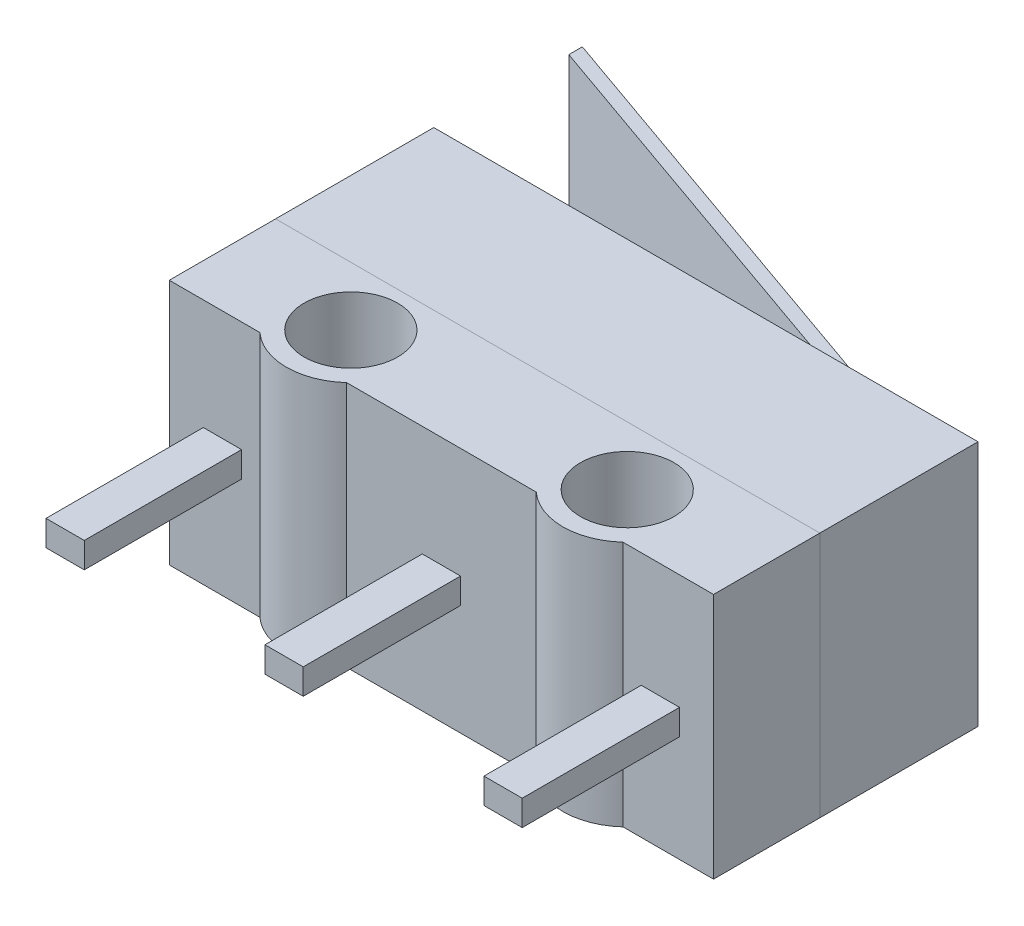
ISO-10303-21;
HEADER;
FILE_DESCRIPTION(('STEP AP214'),'2;1');
FILE_NAME('part.step','',(''),(''),'','','');
FILE_SCHEMA(('AUTOMOTIVE_DESIGN { 1 0 10303 214 1 1 1 1 }'));
ENDSEC;
DATA;
#1=APPLICATION_CONTEXT('core data for automotive mechanical design processes');
#2=APPLICATION_PROTOCOL_DEFINITION('international standard','automotive_design',2000,#1);
#3=PRODUCT_CONTEXT('',#1,'mechanical');
#4=PRODUCT('Part','Part','',(#3));
#5=PRODUCT_RELATED_PRODUCT_CATEGORY('part','',(#4));
#6=PRODUCT_DEFINITION_FORMATION('','',#4);
#7=PRODUCT_DEFINITION_CONTEXT('part definition',#1,'design');
#8=PRODUCT_DEFINITION('design','',#6,#7);
#9=PRODUCT_DEFINITION_SHAPE('','',#8);
#10=(LENGTH_UNIT() NAMED_UNIT(*) SI_UNIT(.MILLI.,.METRE.));
#11=(NAMED_UNIT(*) PLANE_ANGLE_UNIT() SI_UNIT($,.RADIAN.));
#12=(NAMED_UNIT(*) SI_UNIT($,.STERADIAN.) SOLID_ANGLE_UNIT());
#13=UNCERTAINTY_MEASURE_WITH_UNIT(LENGTH_MEASURE(1.E-05),#10,'distance_accuracy_value','');
#14=(GEOMETRIC_REPRESENTATION_CONTEXT(3) GLOBAL_UNCERTAINTY_ASSIGNED_CONTEXT((#13)) GLOBAL_UNIT_ASSIGNED_CONTEXT((#10,
#11,#12)) REPRESENTATION_CONTEXT('',''));
#15=CARTESIAN_POINT('',(0.,0.,0.));
#16=DIRECTION('',(0.,0.,1.));
#17=DIRECTION('',(1.,0.,0.));
#18=AXIS2_PLACEMENT_3D('',#15,#16,#17);
#19=CARTESIAN_POINT('',(0.,0.,6.22));
#20=DIRECTION('',(0.,-1.,0.));
#21=DIRECTION('',(0.,0.,-1.));
#22=AXIS2_PLACEMENT_3D('',#19,#20,#21);
#23=PLANE('',#22);
#24=DIRECTION('',(0.,0.,-1.));
#25=VECTOR('',#24,1.);
#26=CARTESIAN_POINT('',(0.,0.,6.22));
#27=LINE('',#26,#25);
#28=CARTESIAN_POINT('',(0.,0.,3.72));
#29=VERTEX_POINT('',#28);
#30=CARTESIAN_POINT('',(0.,0.,0.));
#31=VERTEX_POINT('',#30);
#32=EDGE_CURVE('E396',#29,#31,#27,.T.);
#33=ORIENTED_EDGE('',*,*,#32,.F.);
#34=DIRECTION('',(-1.,0.,0.));
#35=VECTOR('',#34,1.);
#36=CARTESIAN_POINT('',(0.,0.,3.72));
#37=LINE('',#36,#35);
#38=CARTESIAN_POINT('',(-12.8,0.,3.72));
#39=VERTEX_POINT('',#38);
#40=EDGE_CURVE('E12',#29,#39,#37,.T.);
#41=ORIENTED_EDGE('',*,*,#40,.T.);
#42=DIRECTION('',(0.,0.,-1.));
#43=VECTOR('',#42,1.);
#44=CARTESIAN_POINT('',(-12.8,0.,6.22));
#45=LINE('',#44,#43);
#46=CARTESIAN_POINT('',(-12.8,0.,0.));
#47=VERTEX_POINT('',#46);
#48=EDGE_CURVE('E411',#39,#47,#45,.T.);
#49=ORIENTED_EDGE('',*,*,#48,.T.);
#50=DIRECTION('',(-1.,0.,0.));
#51=VECTOR('',#50,1.);
#52=CARTESIAN_POINT('',(0.,0.,0.));
#53=LINE('',#52,#51);
#54=EDGE_CURVE('E384',#31,#47,#53,.T.);
#55=ORIENTED_EDGE('',*,*,#54,.F.);
#56=EDGE_LOOP('',(#33,#41,#49,#55));
#57=FACE_BOUND('',#56,.T.);
#58=ADVANCED_FACE('F48',(#57),#23,.T.);
#59=CARTESIAN_POINT('',(-12.8,0.,6.22));
#60=DIRECTION('',(-1.,0.,0.));
#61=DIRECTION('',(0.,0.,1.));
#62=AXIS2_PLACEMENT_3D('',#59,#60,#61);
#63=PLANE('',#62);
#64=ORIENTED_EDGE('',*,*,#48,.F.);
#65=DIRECTION('',(0.,1.,0.));
#66=VECTOR('',#65,1.);
#67=CARTESIAN_POINT('',(-12.8,0.,3.72));
#68=LINE('',#67,#66);
#69=CARTESIAN_POINT('',(-12.8,5.8,3.72));
#70=VERTEX_POINT('',#69);
#71=EDGE_CURVE('E56',#39,#70,#68,.T.);
#72=ORIENTED_EDGE('',*,*,#71,.T.);
#73=DIRECTION('',(0.,0.,-1.));
#74=VECTOR('',#73,1.);
#75=CARTESIAN_POINT('',(-12.8,5.8,6.22));
#76=LINE('',#75,#74);
#77=CARTESIAN_POINT('',(-12.8,5.8,0.));
#78=VERTEX_POINT('',#77);
#79=EDGE_CURVE('E415',#70,#78,#76,.T.);
#80=ORIENTED_EDGE('',*,*,#79,.T.);
#81=DIRECTION('',(0.,1.,0.));
#82=VECTOR('',#81,1.);
#83=CARTESIAN_POINT('',(-12.8,0.,0.));
#84=LINE('',#83,#82);
#85=EDGE_CURVE('E403',#47,#78,#84,.T.);
#86=ORIENTED_EDGE('',*,*,#85,.F.);
#87=EDGE_LOOP('',(#64,#72,#80,#86));
#88=FACE_BOUND('',#87,.T.);
#89=ADVANCED_FACE('F477',(#88),#63,.T.);
#90=CARTESIAN_POINT('',(0.,5.8,6.22));
#91=DIRECTION('',(0.,-1.,0.));
#92=DIRECTION('',(1.,0.,0.));
#93=AXIS2_PLACEMENT_3D('',#90,#91,#92);
#94=PLANE('',#93);
#95=CARTESIAN_POINT('',(-3.15,5.8,5.1));
#96=DIRECTION('',(0.,-1.,0.));
#97=DIRECTION('',(0.,0.,-1.));
#98=AXIS2_PLACEMENT_3D('',#95,#96,#97);
#99=CIRCLE('',#98,1.1);
#100=CARTESIAN_POINT('',(-3.15,5.8,4.));
#101=VERTEX_POINT('',#100);
#102=EDGE_CURVE('E370',#101,#101,#99,.T.);
#103=ORIENTED_EDGE('',*,*,#102,.T.);
#104=EDGE_LOOP('',(#103));
#105=FACE_BOUND('',#104,.T.);
#106=CARTESIAN_POINT('',(-9.65,5.8,5.1));
#107=DIRECTION('',(0.,-1.,0.));
#108=DIRECTION('',(0.,0.,-1.));
#109=AXIS2_PLACEMENT_3D('',#106,#107,#108);
#110=CIRCLE('',#109,1.1);
#111=CARTESIAN_POINT('',(-9.65,5.8,4.));
#112=VERTEX_POINT('',#111);
#113=EDGE_CURVE('E376',#112,#112,#110,.T.);
#114=ORIENTED_EDGE('',*,*,#113,.T.);
#115=EDGE_LOOP('',(#114));
#116=FACE_BOUND('',#115,.T.);
#117=DIRECTION('',(0.,0.,-1.));
#118=VECTOR('',#117,1.);
#119=CARTESIAN_POINT('',(0.,5.8,6.22));
#120=LINE('',#119,#118);
#121=CARTESIAN_POINT('',(0.,5.8,6.22));
#122=VERTEX_POINT('',#121);
#123=CARTESIAN_POINT('',(0.,5.8,3.72));
#124=VERTEX_POINT('',#123);
#125=EDGE_CURVE('E420',#122,#124,#120,.T.);
#126=ORIENTED_EDGE('',*,*,#125,.T.);
#127=DIRECTION('',(-1.,0.,0.));
#128=VECTOR('',#127,1.);
#129=CARTESIAN_POINT('',(0.,5.8,3.72));
#130=LINE('',#129,#128);
#131=EDGE_CURVE('E426',#124,#70,#130,.T.);
#132=ORIENTED_EDGE('',*,*,#131,.T.);
#133=CARTESIAN_POINT('',(-12.8,5.8,6.22));
#134=VERTEX_POINT('',#133);
#135=EDGE_CURVE('E416',#134,#70,#76,.T.);
#136=ORIENTED_EDGE('',*,*,#135,.F.);
#137=DIRECTION('',(-1.,0.,0.));
#138=VECTOR('',#137,1.);
#139=CARTESIAN_POINT('',(0.,5.8,6.22));
#140=LINE('',#139,#138);
#141=CARTESIAN_POINT('',(-10.6702083120618,5.8,6.22));
#142=VERTEX_POINT('',#141);
#143=EDGE_CURVE('E383',#142,#134,#140,.T.);
#144=ORIENTED_EDGE('',*,*,#143,.F.);
#145=CARTESIAN_POINT('',(-9.65,5.8,5.1));
#146=DIRECTION('',(0.,-1.,0.));
#147=DIRECTION('',(0.,0.,-1.));
#148=AXIS2_PLACEMENT_3D('',#145,#146,#147);
#149=CIRCLE('',#148,1.515);
#150=CARTESIAN_POINT('',(-8.62979168793819,5.8,6.22));
#151=VERTEX_POINT('',#150);
#152=EDGE_CURVE('E358',#151,#142,#149,.T.);
#153=ORIENTED_EDGE('',*,*,#152,.F.);
#154=CARTESIAN_POINT('',(-4.17020831206181,5.8,6.22));
#155=VERTEX_POINT('',#154);
#156=EDGE_CURVE('E389',#155,#151,#140,.T.);
#157=ORIENTED_EDGE('',*,*,#156,.F.);
#158=CARTESIAN_POINT('',(-3.15,5.8,5.1));
#159=DIRECTION('',(0.,-1.,0.));
#160=DIRECTION('',(0.,0.,-1.));
#161=AXIS2_PLACEMENT_3D('',#158,#159,#160);
#162=CIRCLE('',#161,1.515);
#163=CARTESIAN_POINT('',(-2.12979168793819,5.8,6.22));
#164=VERTEX_POINT('',#163);
#165=EDGE_CURVE('E348',#164,#155,#162,.T.);
#166=ORIENTED_EDGE('',*,*,#165,.F.);
#167=EDGE_CURVE('E385',#122,#164,#140,.T.);
#168=ORIENTED_EDGE('',*,*,#167,.F.);
#169=EDGE_LOOP('',(#126,#132,#136,#144,#153,#157,#166,#168));
#170=FACE_BOUND('',#169,.T.);
#171=ADVANCED_FACE('F430',(#105,#116,#170),#94,.F.);
#172=CARTESIAN_POINT('',(0.,0.,6.22));
#173=DIRECTION('',(-1.,0.,0.));
#174=DIRECTION('',(0.,0.,1.));
#175=AXIS2_PLACEMENT_3D('',#172,#173,#174);
#176=PLANE('',#175);
#177=CARTESIAN_POINT('',(0.,0.,6.22));
#178=VERTEX_POINT('',#177);
#179=EDGE_CURVE('E408',#178,#29,#27,.T.);
#180=ORIENTED_EDGE('',*,*,#179,.T.);
#181=DIRECTION('',(0.,1.,0.));
#182=VECTOR('',#181,1.);
#183=CARTESIAN_POINT('',(0.,0.,3.72));
#184=LINE('',#183,#182);
#185=EDGE_CURVE('E423',#29,#124,#184,.T.);
#186=ORIENTED_EDGE('',*,*,#185,.T.);
#187=ORIENTED_EDGE('',*,*,#125,.F.);
#188=DIRECTION('',(0.,1.,0.));
#189=VECTOR('',#188,1.);
#190=CARTESIAN_POINT('',(0.,0.,6.22));
#191=LINE('',#190,#189);
#192=EDGE_CURVE('E380',#178,#122,#191,.T.);
#193=ORIENTED_EDGE('',*,*,#192,.F.);
#194=EDGE_LOOP('',(#180,#186,#187,#193));
#195=FACE_BOUND('',#194,.T.);
#196=ADVANCED_FACE('F469',(#195),#176,.F.);
#197=CARTESIAN_POINT('',(0.,0.,6.22));
#198=DIRECTION('',(0.,0.,1.));
#199=DIRECTION('',(1.,0.,0.));
#200=AXIS2_PLACEMENT_3D('',#197,#198,#199);
#201=PLANE('',#200);
#202=DIRECTION('',(0.,-1.,0.));
#203=VECTOR('',#202,1.);
#204=CARTESIAN_POINT('',(-2.12979168793819,5.8,6.22));
#205=LINE('',#204,#203);
#206=CARTESIAN_POINT('',(-2.12979168793819,0.,6.22));
#207=VERTEX_POINT('',#206);
#208=EDGE_CURVE('E352',#164,#207,#205,.T.);
#209=ORIENTED_EDGE('',*,*,#208,.T.);
#210=DIRECTION('',(-1.,0.,0.));
#211=VECTOR('',#210,1.);
#212=CARTESIAN_POINT('',(0.,0.,6.22));
#213=LINE('',#212,#211);
#214=EDGE_CURVE('E393',#178,#207,#213,.T.);
#215=ORIENTED_EDGE('',*,*,#214,.F.);
#216=ORIENTED_EDGE('',*,*,#192,.T.);
#217=ORIENTED_EDGE('',*,*,#167,.T.);
#218=EDGE_LOOP('',(#209,#215,#216,#217));
#219=FACE_BOUND('',#218,.T.);
#220=DIRECTION('',(1.,0.,0.));
#221=VECTOR('',#220,1.);
#222=CARTESIAN_POINT('',(-1.7,2.5,6.22));
#223=LINE('',#222,#221);
#224=CARTESIAN_POINT('',(-1.7,2.5,6.22));
#225=VERTEX_POINT('',#224);
#226=CARTESIAN_POINT('',(-0.800000000000001,2.5,6.22));
#227=VERTEX_POINT('',#226);
#228=EDGE_CURVE('E274',#225,#227,#223,.T.);
#229=ORIENTED_EDGE('',*,*,#228,.F.);
#230=DIRECTION('',(0.,-1.,0.));
#231=VECTOR('',#230,1.);
#232=CARTESIAN_POINT('',(-1.7,3.1,6.22));
#233=LINE('',#232,#231);
#234=CARTESIAN_POINT('',(-1.7,3.1,6.22));
#235=VERTEX_POINT('',#234);
#236=EDGE_CURVE('E229',#235,#225,#233,.T.);
#237=ORIENTED_EDGE('',*,*,#236,.F.);
#238=DIRECTION('',(-1.,0.,0.));
#239=VECTOR('',#238,1.);
#240=CARTESIAN_POINT('',(-1.7,3.1,6.22));
#241=LINE('',#240,#239);
#242=CARTESIAN_POINT('',(-0.800000000000001,3.1,6.22));
#243=VERTEX_POINT('',#242);
#244=EDGE_CURVE('E265',#243,#235,#241,.T.);
#245=ORIENTED_EDGE('',*,*,#244,.F.);
#246=DIRECTION('',(0.,1.,0.));
#247=VECTOR('',#246,1.);
#248=CARTESIAN_POINT('',(-0.800000000000001,3.1,6.22));
#249=LINE('',#248,#247);
#250=EDGE_CURVE('E276',#227,#243,#249,.T.);
#251=ORIENTED_EDGE('',*,*,#250,.F.);
#252=EDGE_LOOP('',(#229,#237,#245,#251));
#253=FACE_BOUND('',#252,.T.);
#254=ADVANCED_FACE('F465',(#219,#253),#201,.T.);
#255=DIRECTION('',(0.,-1.,0.));
#256=VECTOR('',#255,1.);
#257=CARTESIAN_POINT('',(-10.6702083120618,5.8,6.22));
#258=LINE('',#257,#256);
#259=CARTESIAN_POINT('',(-10.6702083120618,0.,6.22));
#260=VERTEX_POINT('',#259);
#261=EDGE_CURVE('E360',#142,#260,#258,.T.);
#262=ORIENTED_EDGE('',*,*,#261,.F.);
#263=ORIENTED_EDGE('',*,*,#143,.T.);
#264=DIRECTION('',(0.,1.,0.));
#265=VECTOR('',#264,1.);
#266=CARTESIAN_POINT('',(-12.8,0.,6.22));
#267=LINE('',#266,#265);
#268=CARTESIAN_POINT('',(-12.8,0.,6.22));
#269=VERTEX_POINT('',#268);
#270=EDGE_CURVE('E388',#269,#134,#267,.T.);
#271=ORIENTED_EDGE('',*,*,#270,.F.);
#272=EDGE_CURVE('E392',#260,#269,#213,.T.);
#273=ORIENTED_EDGE('',*,*,#272,.F.);
#274=EDGE_LOOP('',(#262,#263,#271,#273));
#275=FACE_BOUND('',#274,.T.);
#276=DIRECTION('',(1.,0.,0.));
#277=VECTOR('',#276,1.);
#278=CARTESIAN_POINT('',(-12.,2.6,6.22));
#279=LINE('',#278,#277);
#280=CARTESIAN_POINT('',(-12.,2.6,6.22));
#281=VERTEX_POINT('',#280);
#282=CARTESIAN_POINT('',(-11.1,2.6,6.22));
#283=VERTEX_POINT('',#282);
#284=EDGE_CURVE('E303',#281,#283,#279,.T.);
#285=ORIENTED_EDGE('',*,*,#284,.F.);
#286=DIRECTION('',(0.,-1.,0.));
#287=VECTOR('',#286,1.);
#288=CARTESIAN_POINT('',(-12.,3.2,6.22));
#289=LINE('',#288,#287);
#290=CARTESIAN_POINT('',(-12.,3.2,6.22));
#291=VERTEX_POINT('',#290);
#292=EDGE_CURVE('E289',#291,#281,#289,.T.);
#293=ORIENTED_EDGE('',*,*,#292,.F.);
#294=DIRECTION('',(-1.,0.,0.));
#295=VECTOR('',#294,1.);
#296=CARTESIAN_POINT('',(-12.,3.2,6.22));
#297=LINE('',#296,#295);
#298=CARTESIAN_POINT('',(-11.1,3.2,6.22));
#299=VERTEX_POINT('',#298);
#300=EDGE_CURVE('E294',#299,#291,#297,.T.);
#301=ORIENTED_EDGE('',*,*,#300,.F.);
#302=DIRECTION('',(0.,1.,0.));
#303=VECTOR('',#302,1.);
#304=CARTESIAN_POINT('',(-11.1,3.2,6.22));
#305=LINE('',#304,#303);
#306=EDGE_CURVE('E305',#283,#299,#305,.T.);
#307=ORIENTED_EDGE('',*,*,#306,.F.);
#308=EDGE_LOOP('',(#285,#293,#301,#307));
#309=FACE_BOUND('',#308,.T.);
#310=ADVANCED_FACE('F444',(#275,#309),#201,.T.);
#311=DIRECTION('',(0.,-1.,0.));
#312=VECTOR('',#311,1.);
#313=CARTESIAN_POINT('',(-4.17020831206181,5.8,6.22));
#314=LINE('',#313,#312);
#315=CARTESIAN_POINT('',(-4.17020831206181,0.,6.22));
#316=VERTEX_POINT('',#315);
#317=EDGE_CURVE('E350',#155,#316,#314,.T.);
#318=ORIENTED_EDGE('',*,*,#317,.F.);
#319=ORIENTED_EDGE('',*,*,#156,.T.);
#320=DIRECTION('',(0.,-1.,0.));
#321=VECTOR('',#320,1.);
#322=CARTESIAN_POINT('',(-8.62979168793819,5.8,6.22));
#323=LINE('',#322,#321);
#324=CARTESIAN_POINT('',(-8.62979168793819,0.,6.22));
#325=VERTEX_POINT('',#324);
#326=EDGE_CURVE('E362',#151,#325,#323,.T.);
#327=ORIENTED_EDGE('',*,*,#326,.T.);
#328=EDGE_CURVE('E397',#316,#325,#213,.T.);
#329=ORIENTED_EDGE('',*,*,#328,.F.);
#330=EDGE_LOOP('',(#318,#319,#327,#329));
#331=FACE_BOUND('',#330,.T.);
#332=DIRECTION('',(1.,0.,0.));
#333=VECTOR('',#332,1.);
#334=CARTESIAN_POINT('',(-6.85,2.6,6.22));
#335=LINE('',#334,#333);
#336=CARTESIAN_POINT('',(-6.85,2.6,6.22));
#337=VERTEX_POINT('',#336);
#338=CARTESIAN_POINT('',(-5.95,2.6,6.22));
#339=VERTEX_POINT('',#338);
#340=EDGE_CURVE('E332',#337,#339,#335,.T.);
#341=ORIENTED_EDGE('',*,*,#340,.F.);
#342=DIRECTION('',(0.,-1.,0.));
#343=VECTOR('',#342,1.);
#344=CARTESIAN_POINT('',(-6.85,3.2,6.22));
#345=LINE('',#344,#343);
#346=CARTESIAN_POINT('',(-6.85,3.2,6.22));
#347=VERTEX_POINT('',#346);
#348=EDGE_CURVE('E318',#347,#337,#345,.T.);
#349=ORIENTED_EDGE('',*,*,#348,.F.);
#350=DIRECTION('',(-1.,0.,0.));
#351=VECTOR('',#350,1.);
#352=CARTESIAN_POINT('',(-6.85,3.2,6.22));
#353=LINE('',#352,#351);
#354=CARTESIAN_POINT('',(-5.95,3.2,6.22));
#355=VERTEX_POINT('',#354);
#356=EDGE_CURVE('E323',#355,#347,#353,.T.);
#357=ORIENTED_EDGE('',*,*,#356,.F.);
#358=DIRECTION('',(0.,1.,0.));
#359=VECTOR('',#358,1.);
#360=CARTESIAN_POINT('',(-5.95,3.2,6.22));
#361=LINE('',#360,#359);
#362=EDGE_CURVE('E334',#339,#355,#361,.T.);
#363=ORIENTED_EDGE('',*,*,#362,.F.);
#364=EDGE_LOOP('',(#341,#349,#357,#363));
#365=FACE_BOUND('',#364,.T.);
#366=ADVANCED_FACE('F451',(#331,#365),#201,.T.);
#367=ORIENTED_EDGE('',*,*,#185,.F.);
#368=ORIENTED_EDGE('',*,*,#32,.T.);
#369=DIRECTION('',(0.,1.,0.));
#370=VECTOR('',#369,1.);
#371=CARTESIAN_POINT('',(0.,0.,0.));
#372=LINE('',#371,#370);
#373=CARTESIAN_POINT('',(0.,5.8,0.));
#374=VERTEX_POINT('',#373);
#375=EDGE_CURVE('E379',#31,#374,#372,.T.);
#376=ORIENTED_EDGE('',*,*,#375,.T.);
#377=EDGE_CURVE('E419',#124,#374,#120,.T.);
#378=ORIENTED_EDGE('',*,*,#377,.F.);
#379=EDGE_LOOP('',(#367,#368,#376,#378));
#380=FACE_BOUND('',#379,.T.);
#381=ADVANCED_FACE('F50',(#380),#176,.F.);
#382=ORIENTED_EDGE('',*,*,#131,.F.);
#383=ORIENTED_EDGE('',*,*,#377,.T.);
#384=DIRECTION('',(-1.,0.,0.));
#385=VECTOR('',#384,1.);
#386=CARTESIAN_POINT('',(0.,5.8,0.));
#387=LINE('',#386,#385);
#388=EDGE_CURVE('E400',#374,#78,#387,.T.);
#389=ORIENTED_EDGE('',*,*,#388,.T.);
#390=ORIENTED_EDGE('',*,*,#79,.F.);
#391=EDGE_LOOP('',(#382,#383,#389,#390));
#392=FACE_BOUND('',#391,.T.);
#393=ADVANCED_FACE('F434',(#392),#94,.F.);
#394=ORIENTED_EDGE('',*,*,#71,.F.);
#395=EDGE_CURVE('E412',#269,#39,#45,.T.);
#396=ORIENTED_EDGE('',*,*,#395,.F.);
#397=ORIENTED_EDGE('',*,*,#270,.T.);
#398=ORIENTED_EDGE('',*,*,#135,.T.);
#399=EDGE_LOOP('',(#394,#396,#397,#398));
#400=FACE_BOUND('',#399,.T.);
#401=ADVANCED_FACE('F438',(#400),#63,.T.);
#402=ORIENTED_EDGE('',*,*,#40,.F.);
#403=ORIENTED_EDGE('',*,*,#179,.F.);
#404=ORIENTED_EDGE('',*,*,#214,.T.);
#405=CARTESIAN_POINT('',(-3.15,0.,5.1));
#406=DIRECTION('',(0.,-1.,0.));
#407=DIRECTION('',(0.,0.,-1.));
#408=AXIS2_PLACEMENT_3D('',#405,#406,#407);
#409=CIRCLE('',#408,1.515);
#410=EDGE_CURVE('E347',#207,#316,#409,.T.);
#411=ORIENTED_EDGE('',*,*,#410,.T.);
#412=ORIENTED_EDGE('',*,*,#328,.T.);
#413=CARTESIAN_POINT('',(-9.65,0.,5.1));
#414=DIRECTION('',(0.,-1.,0.));
#415=DIRECTION('',(0.,0.,-1.));
#416=AXIS2_PLACEMENT_3D('',#413,#414,#415);
#417=CIRCLE('',#416,1.515);
#418=EDGE_CURVE('E355',#325,#260,#417,.T.);
#419=ORIENTED_EDGE('',*,*,#418,.T.);
#420=ORIENTED_EDGE('',*,*,#272,.T.);
#421=ORIENTED_EDGE('',*,*,#395,.T.);
#422=EDGE_LOOP('',(#402,#403,#404,#411,#412,#419,#420,#421));
#423=FACE_BOUND('',#422,.T.);
#424=CARTESIAN_POINT('',(-3.15,0.,5.1));
#425=DIRECTION('',(0.,-1.,0.));
#426=DIRECTION('',(0.,0.,-1.));
#427=AXIS2_PLACEMENT_3D('',#424,#425,#426);
#428=CIRCLE('',#427,1.09999999999999);
#429=CARTESIAN_POINT('',(-3.15,0.,4.00000000000001));
#430=VERTEX_POINT('',#429);
#431=EDGE_CURVE('E365',#430,#430,#428,.T.);
#432=ORIENTED_EDGE('',*,*,#431,.F.);
#433=EDGE_LOOP('',(#432));
#434=FACE_BOUND('',#433,.T.);
#435=CARTESIAN_POINT('',(-9.65,0.,5.1));
#436=DIRECTION('',(0.,-1.,0.));
#437=DIRECTION('',(0.,0.,-1.));
#438=AXIS2_PLACEMENT_3D('',#435,#436,#437);
#439=CIRCLE('',#438,1.09999999999999);
#440=CARTESIAN_POINT('',(-9.65,0.,4.00000000000001));
#441=VERTEX_POINT('',#440);
#442=EDGE_CURVE('E373',#441,#441,#439,.T.);
#443=ORIENTED_EDGE('',*,*,#442,.F.);
#444=EDGE_LOOP('',(#443));
#445=FACE_BOUND('',#444,.T.);
#446=ADVANCED_FACE('F459',(#423,#434,#445),#23,.T.);
#447=CARTESIAN_POINT('',(0.,0.,0.));
#448=DIRECTION('',(0.,0.,1.));
#449=DIRECTION('',(1.,0.,0.));
#450=AXIS2_PLACEMENT_3D('',#447,#448,#449);
#451=PLANE('',#450);
#452=DIRECTION('',(0.,-1.,0.));
#453=VECTOR('',#452,1.);
#454=CARTESIAN_POINT('',(-0.547326270828165,4.45,0.));
#455=LINE('',#454,#453);
#456=CARTESIAN_POINT('',(-0.547326270828165,4.45,0.));
#457=VERTEX_POINT('',#456);
#458=CARTESIAN_POINT('',(-0.547326270828165,1.35,0.));
#459=VERTEX_POINT('',#458);
#460=EDGE_CURVE('E257',#457,#459,#455,.T.);
#461=ORIENTED_EDGE('',*,*,#460,.F.);
#462=DIRECTION('',(1.,0.,0.));
#463=VECTOR('',#462,1.);
#464=CARTESIAN_POINT('',(0.,4.45,0.));
#465=LINE('',#464,#463);
#466=CARTESIAN_POINT('',(-1.45267372917184,4.45,0.));
#467=VERTEX_POINT('',#466);
#468=EDGE_CURVE('E243',#467,#457,#465,.T.);
#469=ORIENTED_EDGE('',*,*,#468,.F.);
#470=DIRECTION('',(0.,-1.,0.));
#471=VECTOR('',#470,1.);
#472=CARTESIAN_POINT('',(-1.45267372917183,4.45,0.));
#473=LINE('',#472,#471);
#474=CARTESIAN_POINT('',(-1.45267372917183,1.35,0.));
#475=VERTEX_POINT('',#474);
#476=EDGE_CURVE('E230',#467,#475,#473,.T.);
#477=ORIENTED_EDGE('',*,*,#476,.T.);
#478=DIRECTION('',(1.,0.,0.));
#479=VECTOR('',#478,1.);
#480=CARTESIAN_POINT('',(0.,1.35,0.));
#481=LINE('',#480,#479);
#482=EDGE_CURVE('E252',#475,#459,#481,.T.);
#483=ORIENTED_EDGE('',*,*,#482,.T.);
#484=EDGE_LOOP('',(#461,#469,#477,#483));
#485=FACE_BOUND('',#484,.T.);
#486=ORIENTED_EDGE('',*,*,#375,.F.);
#487=ORIENTED_EDGE('',*,*,#54,.T.);
#488=ORIENTED_EDGE('',*,*,#85,.T.);
#489=ORIENTED_EDGE('',*,*,#388,.F.);
#490=EDGE_LOOP('',(#486,#487,#488,#489));
#491=FACE_BOUND('',#490,.T.);
#492=ADVANCED_FACE('F475',(#485,#491),#451,.F.);
#493=CARTESIAN_POINT('',(-9.65,0.,5.1));
#494=DIRECTION('',(0.,-1.,0.));
#495=DIRECTION('',(0.,0.,-1.));
#496=AXIS2_PLACEMENT_3D('',#493,#494,#495);
#497=CYLINDRICAL_SURFACE('',#496,1.09999999999999);
#498=ORIENTED_EDGE('',*,*,#113,.F.);
#499=EDGE_LOOP('',(#498));
#500=FACE_BOUND('',#499,.T.);
#501=ORIENTED_EDGE('',*,*,#442,.T.);
#502=EDGE_LOOP('',(#501));
#503=FACE_BOUND('',#502,.T.);
#504=ADVANCED_FACE('F490',(#500,#503),#497,.F.);
#505=CARTESIAN_POINT('',(-3.15,0.,5.1));
#506=DIRECTION('',(0.,-1.,0.));
#507=DIRECTION('',(0.,0.,-1.));
#508=AXIS2_PLACEMENT_3D('',#505,#506,#507);
#509=CYLINDRICAL_SURFACE('',#508,1.09999999999999);
#510=ORIENTED_EDGE('',*,*,#102,.F.);
#511=EDGE_LOOP('',(#510));
#512=FACE_BOUND('',#511,.T.);
#513=ORIENTED_EDGE('',*,*,#431,.T.);
#514=EDGE_LOOP('',(#513));
#515=FACE_BOUND('',#514,.T.);
#516=ADVANCED_FACE('F509',(#512,#515),#509,.F.);
#517=CARTESIAN_POINT('',(-9.65,5.8,5.1));
#518=DIRECTION('',(0.,-1.,0.));
#519=DIRECTION('',(0.,0.,-1.));
#520=AXIS2_PLACEMENT_3D('',#517,#518,#519);
#521=CYLINDRICAL_SURFACE('',#520,1.515);
#522=ORIENTED_EDGE('',*,*,#418,.F.);
#523=ORIENTED_EDGE('',*,*,#326,.F.);
#524=ORIENTED_EDGE('',*,*,#152,.T.);
#525=ORIENTED_EDGE('',*,*,#261,.T.);
#526=EDGE_LOOP('',(#522,#523,#524,#525));
#527=FACE_BOUND('',#526,.T.);
#528=ADVANCED_FACE('F457',(#527),#521,.T.);
#529=CARTESIAN_POINT('',(-3.15,5.8,5.1));
#530=DIRECTION('',(0.,-1.,0.));
#531=DIRECTION('',(0.,0.,-1.));
#532=AXIS2_PLACEMENT_3D('',#529,#530,#531);
#533=CYLINDRICAL_SURFACE('',#532,1.515);
#534=ORIENTED_EDGE('',*,*,#410,.F.);
#535=ORIENTED_EDGE('',*,*,#208,.F.);
#536=ORIENTED_EDGE('',*,*,#165,.T.);
#537=ORIENTED_EDGE('',*,*,#317,.T.);
#538=EDGE_LOOP('',(#534,#535,#536,#537));
#539=FACE_BOUND('',#538,.T.);
#540=ADVANCED_FACE('F463',(#539),#533,.T.);
#541=CARTESIAN_POINT('',(-6.85,3.2,9.92));
#542=DIRECTION('',(1.,0.,0.));
#543=DIRECTION('',(0.,0.,-1.));
#544=AXIS2_PLACEMENT_3D('',#541,#542,#543);
#545=PLANE('',#544);
#546=ORIENTED_EDGE('',*,*,#348,.T.);
#547=DIRECTION('',(0.,0.,-1.));
#548=VECTOR('',#547,1.);
#549=CARTESIAN_POINT('',(-6.85,2.6,9.92));
#550=LINE('',#549,#548);
#551=CARTESIAN_POINT('',(-6.85,2.6,9.92));
#552=VERTEX_POINT('',#551);
#553=EDGE_CURVE('E345',#552,#337,#550,.T.);
#554=ORIENTED_EDGE('',*,*,#553,.F.);
#555=DIRECTION('',(0.,-1.,0.));
#556=VECTOR('',#555,1.);
#557=CARTESIAN_POINT('',(-6.85,3.2,9.92));
#558=LINE('',#557,#556);
#559=CARTESIAN_POINT('',(-6.85,3.2,9.92));
#560=VERTEX_POINT('',#559);
#561=EDGE_CURVE('E319',#560,#552,#558,.T.);
#562=ORIENTED_EDGE('',*,*,#561,.F.);
#563=DIRECTION('',(0.,0.,-1.));
#564=VECTOR('',#563,1.);
#565=CARTESIAN_POINT('',(-6.85,3.2,9.92));
#566=LINE('',#565,#564);
#567=EDGE_CURVE('E329',#560,#347,#566,.T.);
#568=ORIENTED_EDGE('',*,*,#567,.T.);
#569=EDGE_LOOP('',(#546,#554,#562,#568));
#570=FACE_BOUND('',#569,.T.);
#571=ADVANCED_FACE('F580',(#570),#545,.F.);
#572=CARTESIAN_POINT('',(-6.85,2.6,9.92));
#573=DIRECTION('',(0.,1.,0.));
#574=DIRECTION('',(0.,0.,1.));
#575=AXIS2_PLACEMENT_3D('',#572,#573,#574);
#576=PLANE('',#575);
#577=ORIENTED_EDGE('',*,*,#340,.T.);
#578=DIRECTION('',(0.,0.,-1.));
#579=VECTOR('',#578,1.);
#580=CARTESIAN_POINT('',(-5.95,2.6,9.92));
#581=LINE('',#580,#579);
#582=CARTESIAN_POINT('',(-5.95,2.6,9.92));
#583=VERTEX_POINT('',#582);
#584=EDGE_CURVE('E342',#583,#339,#581,.T.);
#585=ORIENTED_EDGE('',*,*,#584,.F.);
#586=DIRECTION('',(1.,0.,0.));
#587=VECTOR('',#586,1.);
#588=CARTESIAN_POINT('',(-6.85,2.6,9.92));
#589=LINE('',#588,#587);
#590=EDGE_CURVE('E322',#552,#583,#589,.T.);
#591=ORIENTED_EDGE('',*,*,#590,.F.);
#592=ORIENTED_EDGE('',*,*,#553,.T.);
#593=EDGE_LOOP('',(#577,#585,#591,#592));
#594=FACE_BOUND('',#593,.T.);
#595=ADVANCED_FACE('F589',(#594),#576,.F.);
#596=CARTESIAN_POINT('',(-5.95,3.2,9.92));
#597=DIRECTION('',(-1.,0.,0.));
#598=DIRECTION('',(0.,-1.,0.));
#599=AXIS2_PLACEMENT_3D('',#596,#597,#598);
#600=PLANE('',#599);
#601=ORIENTED_EDGE('',*,*,#362,.T.);
#602=DIRECTION('',(0.,0.,-1.));
#603=VECTOR('',#602,1.);
#604=CARTESIAN_POINT('',(-5.95,3.2,9.92));
#605=LINE('',#604,#603);
#606=CARTESIAN_POINT('',(-5.95,3.2,9.92));
#607=VERTEX_POINT('',#606);
#608=EDGE_CURVE('E340',#607,#355,#605,.T.);
#609=ORIENTED_EDGE('',*,*,#608,.F.);
#610=DIRECTION('',(0.,1.,0.));
#611=VECTOR('',#610,1.);
#612=CARTESIAN_POINT('',(-5.95,3.2,9.92));
#613=LINE('',#612,#611);
#614=EDGE_CURVE('E325',#583,#607,#613,.T.);
#615=ORIENTED_EDGE('',*,*,#614,.F.);
#616=ORIENTED_EDGE('',*,*,#584,.T.);
#617=EDGE_LOOP('',(#601,#609,#615,#616));
#618=FACE_BOUND('',#617,.T.);
#619=ADVANCED_FACE('F600',(#618),#600,.F.);
#620=CARTESIAN_POINT('',(-6.85,3.2,9.92));
#621=DIRECTION('',(0.,-1.,0.));
#622=DIRECTION('',(0.,0.,-1.));
#623=AXIS2_PLACEMENT_3D('',#620,#621,#622);
#624=PLANE('',#623);
#625=ORIENTED_EDGE('',*,*,#356,.T.);
#626=ORIENTED_EDGE('',*,*,#567,.F.);
#627=DIRECTION('',(-1.,0.,0.));
#628=VECTOR('',#627,1.);
#629=CARTESIAN_POINT('',(-6.85,3.2,9.92));
#630=LINE('',#629,#628);
#631=EDGE_CURVE('E327',#607,#560,#630,.T.);
#632=ORIENTED_EDGE('',*,*,#631,.F.);
#633=ORIENTED_EDGE('',*,*,#608,.T.);
#634=EDGE_LOOP('',(#625,#626,#632,#633));
#635=FACE_BOUND('',#634,.T.);
#636=ADVANCED_FACE('F610',(#635),#624,.F.);
#637=CARTESIAN_POINT('',(0.,0.,9.92));
#638=DIRECTION('',(0.,0.,1.));
#639=DIRECTION('',(1.,0.,0.));
#640=AXIS2_PLACEMENT_3D('',#637,#638,#639);
#641=PLANE('',#640);
#642=ORIENTED_EDGE('',*,*,#561,.T.);
#643=ORIENTED_EDGE('',*,*,#590,.T.);
#644=ORIENTED_EDGE('',*,*,#614,.T.);
#645=ORIENTED_EDGE('',*,*,#631,.T.);
#646=EDGE_LOOP('',(#642,#643,#644,#645));
#647=FACE_BOUND('',#646,.T.);
#648=ADVANCED_FACE('F620',(#647),#641,.T.);
#649=CARTESIAN_POINT('',(-12.,3.2,9.92));
#650=DIRECTION('',(1.,0.,0.));
#651=DIRECTION('',(0.,0.,-1.));
#652=AXIS2_PLACEMENT_3D('',#649,#650,#651);
#653=PLANE('',#652);
#654=ORIENTED_EDGE('',*,*,#292,.T.);
#655=DIRECTION('',(0.,0.,-1.));
#656=VECTOR('',#655,1.);
#657=CARTESIAN_POINT('',(-12.,2.6,9.92));
#658=LINE('',#657,#656);
#659=CARTESIAN_POINT('',(-12.,2.6,9.92));
#660=VERTEX_POINT('',#659);
#661=EDGE_CURVE('E316',#660,#281,#658,.T.);
#662=ORIENTED_EDGE('',*,*,#661,.F.);
#663=DIRECTION('',(0.,-1.,0.));
#664=VECTOR('',#663,1.);
#665=CARTESIAN_POINT('',(-12.,3.2,9.92));
#666=LINE('',#665,#664);
#667=CARTESIAN_POINT('',(-12.,3.2,9.92));
#668=VERTEX_POINT('',#667);
#669=EDGE_CURVE('E290',#668,#660,#666,.T.);
#670=ORIENTED_EDGE('',*,*,#669,.F.);
#671=DIRECTION('',(0.,0.,-1.));
#672=VECTOR('',#671,1.);
#673=CARTESIAN_POINT('',(-12.,3.2,9.92));
#674=LINE('',#673,#672);
#675=EDGE_CURVE('E300',#668,#291,#674,.T.);
#676=ORIENTED_EDGE('',*,*,#675,.T.);
#677=EDGE_LOOP('',(#654,#662,#670,#676));
#678=FACE_BOUND('',#677,.T.);
#679=ADVANCED_FACE('F630',(#678),#653,.F.);
#680=CARTESIAN_POINT('',(-12.,2.6,9.92));
#681=DIRECTION('',(0.,1.,0.));
#682=DIRECTION('',(0.,0.,1.));
#683=AXIS2_PLACEMENT_3D('',#680,#681,#682);
#684=PLANE('',#683);
#685=ORIENTED_EDGE('',*,*,#284,.T.);
#686=DIRECTION('',(0.,0.,-1.));
#687=VECTOR('',#686,1.);
#688=CARTESIAN_POINT('',(-11.1,2.6,9.92));
#689=LINE('',#688,#687);
#690=CARTESIAN_POINT('',(-11.1,2.6,9.92));
#691=VERTEX_POINT('',#690);
#692=EDGE_CURVE('E313',#691,#283,#689,.T.);
#693=ORIENTED_EDGE('',*,*,#692,.F.);
#694=DIRECTION('',(1.,0.,0.));
#695=VECTOR('',#694,1.);
#696=CARTESIAN_POINT('',(-12.,2.6,9.92));
#697=LINE('',#696,#695);
#698=EDGE_CURVE('E293',#660,#691,#697,.T.);
#699=ORIENTED_EDGE('',*,*,#698,.F.);
#700=ORIENTED_EDGE('',*,*,#661,.T.);
#701=EDGE_LOOP('',(#685,#693,#699,#700));
#702=FACE_BOUND('',#701,.T.);
#703=ADVANCED_FACE('F640',(#702),#684,.F.);
#704=CARTESIAN_POINT('',(-11.1,3.2,9.92));
#705=DIRECTION('',(-1.,0.,0.));
#706=DIRECTION('',(0.,0.,1.));
#707=AXIS2_PLACEMENT_3D('',#704,#705,#706);
#708=PLANE('',#707);
#709=ORIENTED_EDGE('',*,*,#306,.T.);
#710=DIRECTION('',(0.,0.,-1.));
#711=VECTOR('',#710,1.);
#712=CARTESIAN_POINT('',(-11.1,3.2,9.92));
#713=LINE('',#712,#711);
#714=CARTESIAN_POINT('',(-11.1,3.2,9.92));
#715=VERTEX_POINT('',#714);
#716=EDGE_CURVE('E311',#715,#299,#713,.T.);
#717=ORIENTED_EDGE('',*,*,#716,.F.);
#718=DIRECTION('',(0.,1.,0.));
#719=VECTOR('',#718,1.);
#720=CARTESIAN_POINT('',(-11.1,3.2,9.92));
#721=LINE('',#720,#719);
#722=EDGE_CURVE('E296',#691,#715,#721,.T.);
#723=ORIENTED_EDGE('',*,*,#722,.F.);
#724=ORIENTED_EDGE('',*,*,#692,.T.);
#725=EDGE_LOOP('',(#709,#717,#723,#724));
#726=FACE_BOUND('',#725,.T.);
#727=ADVANCED_FACE('F650',(#726),#708,.F.);
#728=CARTESIAN_POINT('',(-12.,3.2,9.92));
#729=DIRECTION('',(0.,-1.,0.));
#730=DIRECTION('',(1.,0.,0.));
#731=AXIS2_PLACEMENT_3D('',#728,#729,#730);
#732=PLANE('',#731);
#733=ORIENTED_EDGE('',*,*,#300,.T.);
#734=ORIENTED_EDGE('',*,*,#675,.F.);
#735=DIRECTION('',(-1.,0.,0.));
#736=VECTOR('',#735,1.);
#737=CARTESIAN_POINT('',(-12.,3.2,9.92));
#738=LINE('',#737,#736);
#739=EDGE_CURVE('E298',#715,#668,#738,.T.);
#740=ORIENTED_EDGE('',*,*,#739,.F.);
#741=ORIENTED_EDGE('',*,*,#716,.T.);
#742=EDGE_LOOP('',(#733,#734,#740,#741));
#743=FACE_BOUND('',#742,.T.);
#744=ADVANCED_FACE('F660',(#743),#732,.F.);
#745=CARTESIAN_POINT('',(0.,0.,9.92));
#746=DIRECTION('',(0.,0.,1.));
#747=DIRECTION('',(1.,0.,0.));
#748=AXIS2_PLACEMENT_3D('',#745,#746,#747);
#749=PLANE('',#748);
#750=ORIENTED_EDGE('',*,*,#669,.T.);
#751=ORIENTED_EDGE('',*,*,#698,.T.);
#752=ORIENTED_EDGE('',*,*,#722,.T.);
#753=ORIENTED_EDGE('',*,*,#739,.T.);
#754=EDGE_LOOP('',(#750,#751,#752,#753));
#755=FACE_BOUND('',#754,.T.);
#756=ADVANCED_FACE('F670',(#755),#749,.T.);
#757=CARTESIAN_POINT('',(-1.7,3.1,9.92));
#758=DIRECTION('',(1.,0.,0.));
#759=DIRECTION('',(0.,0.,-1.));
#760=AXIS2_PLACEMENT_3D('',#757,#758,#759);
#761=PLANE('',#760);
#762=ORIENTED_EDGE('',*,*,#236,.T.);
#763=DIRECTION('',(0.,0.,-1.));
#764=VECTOR('',#763,1.);
#765=CARTESIAN_POINT('',(-1.7,2.5,9.92));
#766=LINE('',#765,#764);
#767=CARTESIAN_POINT('',(-1.7,2.5,9.92));
#768=VERTEX_POINT('',#767);
#769=EDGE_CURVE('E287',#768,#225,#766,.T.);
#770=ORIENTED_EDGE('',*,*,#769,.F.);
#771=DIRECTION('',(0.,-1.,0.));
#772=VECTOR('',#771,1.);
#773=CARTESIAN_POINT('',(-1.7,3.1,9.92));
#774=LINE('',#773,#772);
#775=CARTESIAN_POINT('',(-1.7,3.1,9.92));
#776=VERTEX_POINT('',#775);
#777=EDGE_CURVE('E261',#776,#768,#774,.T.);
#778=ORIENTED_EDGE('',*,*,#777,.F.);
#779=DIRECTION('',(0.,0.,-1.));
#780=VECTOR('',#779,1.);
#781=CARTESIAN_POINT('',(-1.7,3.1,9.92));
#782=LINE('',#781,#780);
#783=EDGE_CURVE('E271',#776,#235,#782,.T.);
#784=ORIENTED_EDGE('',*,*,#783,.T.);
#785=EDGE_LOOP('',(#762,#770,#778,#784));
#786=FACE_BOUND('',#785,.T.);
#787=ADVANCED_FACE('F680',(#786),#761,.F.);
#788=CARTESIAN_POINT('',(-1.7,2.5,9.92));
#789=DIRECTION('',(0.,1.,0.));
#790=DIRECTION('',(0.,0.,1.));
#791=AXIS2_PLACEMENT_3D('',#788,#789,#790);
#792=PLANE('',#791);
#793=ORIENTED_EDGE('',*,*,#228,.T.);
#794=DIRECTION('',(0.,0.,-1.));
#795=VECTOR('',#794,1.);
#796=CARTESIAN_POINT('',(-0.800000000000001,2.5,9.92));
#797=LINE('',#796,#795);
#798=CARTESIAN_POINT('',(-0.800000000000001,2.5,9.92));
#799=VERTEX_POINT('',#798);
#800=EDGE_CURVE('E284',#799,#227,#797,.T.);
#801=ORIENTED_EDGE('',*,*,#800,.F.);
#802=DIRECTION('',(1.,0.,0.));
#803=VECTOR('',#802,1.);
#804=CARTESIAN_POINT('',(-1.7,2.5,9.92));
#805=LINE('',#804,#803);
#806=EDGE_CURVE('E264',#768,#799,#805,.T.);
#807=ORIENTED_EDGE('',*,*,#806,.F.);
#808=ORIENTED_EDGE('',*,*,#769,.T.);
#809=EDGE_LOOP('',(#793,#801,#807,#808));
#810=FACE_BOUND('',#809,.T.);
#811=ADVANCED_FACE('F690',(#810),#792,.F.);
#812=CARTESIAN_POINT('',(-0.800000000000001,3.1,9.92));
#813=DIRECTION('',(-1.,0.,0.));
#814=DIRECTION('',(0.,-1.,0.));
#815=AXIS2_PLACEMENT_3D('',#812,#813,#814);
#816=PLANE('',#815);
#817=ORIENTED_EDGE('',*,*,#250,.T.);
#818=DIRECTION('',(0.,0.,-1.));
#819=VECTOR('',#818,1.);
#820=CARTESIAN_POINT('',(-0.800000000000001,3.1,9.92));
#821=LINE('',#820,#819);
#822=CARTESIAN_POINT('',(-0.800000000000001,3.1,9.92));
#823=VERTEX_POINT('',#822);
#824=EDGE_CURVE('E282',#823,#243,#821,.T.);
#825=ORIENTED_EDGE('',*,*,#824,.F.);
#826=DIRECTION('',(0.,1.,0.));
#827=VECTOR('',#826,1.);
#828=CARTESIAN_POINT('',(-0.800000000000001,3.1,9.92));
#829=LINE('',#828,#827);
#830=EDGE_CURVE('E267',#799,#823,#829,.T.);
#831=ORIENTED_EDGE('',*,*,#830,.F.);
#832=ORIENTED_EDGE('',*,*,#800,.T.);
#833=EDGE_LOOP('',(#817,#825,#831,#832));
#834=FACE_BOUND('',#833,.T.);
#835=ADVANCED_FACE('F700',(#834),#816,.F.);
#836=CARTESIAN_POINT('',(-1.7,3.1,9.92));
#837=DIRECTION('',(0.,-1.,0.));
#838=DIRECTION('',(0.,0.,-1.));
#839=AXIS2_PLACEMENT_3D('',#836,#837,#838);
#840=PLANE('',#839);
#841=ORIENTED_EDGE('',*,*,#244,.T.);
#842=ORIENTED_EDGE('',*,*,#783,.F.);
#843=DIRECTION('',(-1.,0.,0.));
#844=VECTOR('',#843,1.);
#845=CARTESIAN_POINT('',(-1.7,3.1,9.92));
#846=LINE('',#845,#844);
#847=EDGE_CURVE('E269',#823,#776,#846,.T.);
#848=ORIENTED_EDGE('',*,*,#847,.F.);
#849=ORIENTED_EDGE('',*,*,#824,.T.);
#850=EDGE_LOOP('',(#841,#842,#848,#849));
#851=FACE_BOUND('',#850,.T.);
#852=ADVANCED_FACE('F710',(#851),#840,.F.);
#853=CARTESIAN_POINT('',(0.,0.,9.92));
#854=DIRECTION('',(0.,0.,1.));
#855=DIRECTION('',(1.,0.,0.));
#856=AXIS2_PLACEMENT_3D('',#853,#854,#855);
#857=PLANE('',#856);
#858=ORIENTED_EDGE('',*,*,#777,.T.);
#859=ORIENTED_EDGE('',*,*,#806,.T.);
#860=ORIENTED_EDGE('',*,*,#830,.T.);
#861=ORIENTED_EDGE('',*,*,#847,.T.);
#862=EDGE_LOOP('',(#858,#859,#860,#861));
#863=FACE_BOUND('',#862,.T.);
#864=ADVANCED_FACE('F720',(#863),#857,.T.);
#865=CARTESIAN_POINT('',(-14.0473262708282,4.45,0.));
#866=DIRECTION('',(-1.,0.,0.));
#867=DIRECTION('',(0.,0.,1.));
#868=AXIS2_PLACEMENT_3D('',#865,#866,#867);
#869=PLANE('',#868);
#870=DIRECTION('',(0.,0.,-1.));
#871=VECTOR('',#870,1.);
#872=CARTESIAN_POINT('',(-14.0473262708282,1.35,0.));
#873=LINE('',#872,#871);
#874=CARTESIAN_POINT('',(-14.0473262708282,1.35,-4.42332607635903));
#875=VERTEX_POINT('',#874);
#876=CARTESIAN_POINT('',(-14.0473262708282,1.35,-4.7412901493981));
#877=VERTEX_POINT('',#876);
#878=EDGE_CURVE('E224',#875,#877,#873,.T.);
#879=ORIENTED_EDGE('',*,*,#878,.F.);
#880=DIRECTION('',(0.,-1.,0.));
#881=VECTOR('',#880,1.);
#882=CARTESIAN_POINT('',(-14.0473262708282,4.45,-4.42332607635903));
#883=LINE('',#882,#881);
#884=CARTESIAN_POINT('',(-14.0473262708282,4.45,-4.42332607635903));
#885=VERTEX_POINT('',#884);
#886=EDGE_CURVE('E218',#885,#875,#883,.T.);
#887=ORIENTED_EDGE('',*,*,#886,.F.);
#888=DIRECTION('',(0.,0.,-1.));
#889=VECTOR('',#888,1.);
#890=CARTESIAN_POINT('',(-14.0473262708282,4.45,0.));
#891=LINE('',#890,#889);
#892=CARTESIAN_POINT('',(-14.0473262708282,4.45,-4.7412901493981));
#893=VERTEX_POINT('',#892);
#894=EDGE_CURVE('E221',#885,#893,#891,.T.);
#895=ORIENTED_EDGE('',*,*,#894,.T.);
#896=DIRECTION('',(0.,-1.,0.));
#897=VECTOR('',#896,1.);
#898=CARTESIAN_POINT('',(-14.0473262708282,4.45,-4.7412901493981));
#899=LINE('',#898,#897);
#900=EDGE_CURVE('E248',#893,#877,#899,.T.);
#901=ORIENTED_EDGE('',*,*,#900,.T.);
#902=EDGE_LOOP('',(#879,#887,#895,#901));
#903=FACE_BOUND('',#902,.T.);
#904=ADVANCED_FACE('F220',(#903),#869,.T.);
#905=CARTESIAN_POINT('',(-0.159507099804053,4.45,0.454168755655689));
#906=DIRECTION('',(-0.331364491317896,0.,0.943502821349058));
#907=DIRECTION('',(0.943502821349058,0.,0.331364491317896));
#908=AXIS2_PLACEMENT_3D('',#905,#906,#907);
#909=PLANE('',#908);
#910=DIRECTION('',(-0.943502821349058,0.,-0.331364491317896));
#911=VECTOR('',#910,1.);
#912=CARTESIAN_POINT('',(-0.159507099804053,1.35,0.454168755655689));
#913=LINE('',#912,#911);
#914=EDGE_CURVE('E250',#475,#875,#913,.T.);
#915=ORIENTED_EDGE('',*,*,#914,.F.);
#916=ORIENTED_EDGE('',*,*,#476,.F.);
#917=DIRECTION('',(-0.943502821349058,0.,-0.331364491317896));
#918=VECTOR('',#917,1.);
#919=CARTESIAN_POINT('',(-0.159507099804053,4.45,0.454168755655689));
#920=LINE('',#919,#918);
#921=EDGE_CURVE('E236',#467,#885,#920,.T.);
#922=ORIENTED_EDGE('',*,*,#921,.T.);
#923=ORIENTED_EDGE('',*,*,#886,.T.);
#924=EDGE_LOOP('',(#915,#916,#922,#923));
#925=FACE_BOUND('',#924,.T.);
#926=ADVANCED_FACE('F242',(#925),#909,.T.);
#927=CARTESIAN_POINT('',(-0.0600977524086836,4.45,0.171117909250972));
#928=DIRECTION('',(0.331364491317896,0.,-0.943502821349058));
#929=DIRECTION('',(-0.943502821349058,0.,-0.331364491317896));
#930=AXIS2_PLACEMENT_3D('',#927,#928,#929);
#931=PLANE('',#930);
#932=DIRECTION('',(0.943502821349058,0.,0.331364491317896));
#933=VECTOR('',#932,1.);
#934=CARTESIAN_POINT('',(-0.0600977524086836,1.35,0.171117909250972));
#935=LINE('',#934,#933);
#936=EDGE_CURVE('E239',#877,#459,#935,.T.);
#937=ORIENTED_EDGE('',*,*,#936,.F.);
#938=ORIENTED_EDGE('',*,*,#900,.F.);
#939=DIRECTION('',(0.943502821349058,0.,0.331364491317896));
#940=VECTOR('',#939,1.);
#941=CARTESIAN_POINT('',(-0.0600977524086836,4.45,0.171117909250972));
#942=LINE('',#941,#940);
#943=EDGE_CURVE('E238',#893,#457,#942,.T.);
#944=ORIENTED_EDGE('',*,*,#943,.T.);
#945=ORIENTED_EDGE('',*,*,#460,.T.);
#946=EDGE_LOOP('',(#937,#938,#944,#945));
#947=FACE_BOUND('',#946,.T.);
#948=ADVANCED_FACE('F747',(#947),#931,.T.);
#949=CARTESIAN_POINT('',(0.,4.45,0.));
#950=DIRECTION('',(0.,1.,0.));
#951=DIRECTION('',(0.,0.,1.));
#952=AXIS2_PLACEMENT_3D('',#949,#950,#951);
#953=PLANE('',#952);
#954=ORIENTED_EDGE('',*,*,#894,.F.);
#955=ORIENTED_EDGE('',*,*,#921,.F.);
#956=ORIENTED_EDGE('',*,*,#468,.T.);
#957=ORIENTED_EDGE('',*,*,#943,.F.);
#958=EDGE_LOOP('',(#954,#955,#956,#957));
#959=FACE_BOUND('',#958,.T.);
#960=ADVANCED_FACE('F234',(#959),#953,.T.);
#961=CARTESIAN_POINT('',(0.,1.35,0.));
#962=DIRECTION('',(0.,1.,0.));
#963=DIRECTION('',(0.,0.,1.));
#964=AXIS2_PLACEMENT_3D('',#961,#962,#963);
#965=PLANE('',#964);
#966=ORIENTED_EDGE('',*,*,#878,.T.);
#967=ORIENTED_EDGE('',*,*,#936,.T.);
#968=ORIENTED_EDGE('',*,*,#482,.F.);
#969=ORIENTED_EDGE('',*,*,#914,.T.);
#970=EDGE_LOOP('',(#966,#967,#968,#969));
#971=FACE_BOUND('',#970,.T.);
#972=ADVANCED_FACE('F765',(#971),#965,.F.);
#973=CLOSED_SHELL('',(#58,#89,#171,#196,#254,#310,#366,#381,#393,#401,#446,#492,#504,#516,#528,
#540,#571,#595,#619,#636,#648,#679,#703,#727,#744,#756,#787,#811,#835,#852,#864,#904,#926,#948,
#960,#972));
#974=MANIFOLD_SOLID_BREP('B2',#973);
#975=ADVANCED_BREP_SHAPE_REPRESENTATION('',(#18,#974),#14);
#976=SHAPE_DEFINITION_REPRESENTATION(#9,#975);
ENDSEC;
END-ISO-10303-21;
